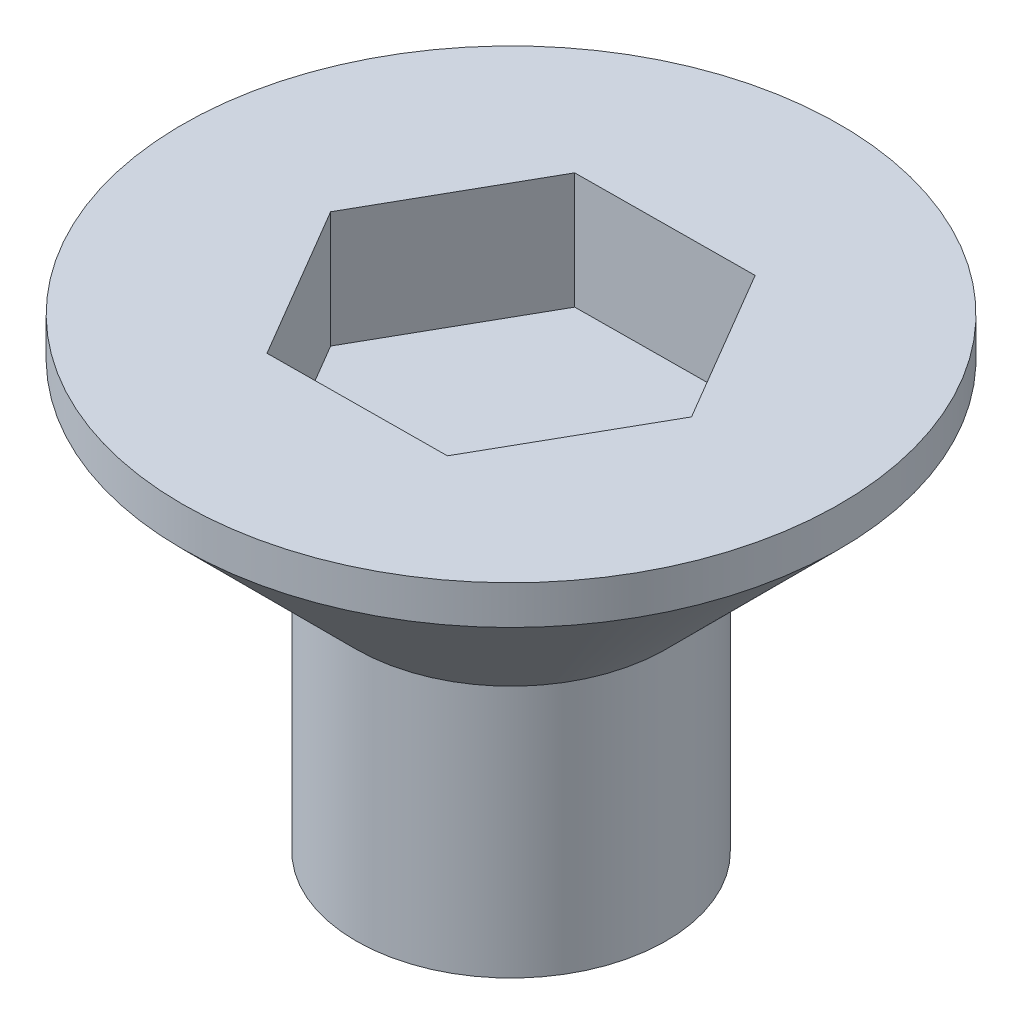
ISO-10303-21;
HEADER;
FILE_DESCRIPTION(('STEP AP214'),'2;1');
FILE_NAME('part.step','',(''),(''),'','','');
FILE_SCHEMA(('AUTOMOTIVE_DESIGN { 1 0 10303 214 1 1 1 1 }'));
ENDSEC;
DATA;
#1=APPLICATION_CONTEXT('core data for automotive mechanical design processes');
#2=APPLICATION_PROTOCOL_DEFINITION('international standard','automotive_design',2000,#1);
#3=PRODUCT_CONTEXT('',#1,'mechanical');
#4=PRODUCT('Part','Part','',(#3));
#5=PRODUCT_RELATED_PRODUCT_CATEGORY('part','',(#4));
#6=PRODUCT_DEFINITION_FORMATION('','',#4);
#7=PRODUCT_DEFINITION_CONTEXT('part definition',#1,'design');
#8=PRODUCT_DEFINITION('design','',#6,#7);
#9=PRODUCT_DEFINITION_SHAPE('','',#8);
#10=(LENGTH_UNIT() NAMED_UNIT(*) SI_UNIT(.MILLI.,.METRE.));
#11=(NAMED_UNIT(*) PLANE_ANGLE_UNIT() SI_UNIT($,.RADIAN.));
#12=(NAMED_UNIT(*) SI_UNIT($,.STERADIAN.) SOLID_ANGLE_UNIT());
#13=UNCERTAINTY_MEASURE_WITH_UNIT(LENGTH_MEASURE(1.E-05),#10,'distance_accuracy_value','');
#14=(GEOMETRIC_REPRESENTATION_CONTEXT(3) GLOBAL_UNCERTAINTY_ASSIGNED_CONTEXT((#13)) GLOBAL_UNIT_ASSIGNED_CONTEXT((#10,
#11,#12)) REPRESENTATION_CONTEXT('',''));
#15=CARTESIAN_POINT('',(0.,0.,0.));
#16=DIRECTION('',(0.,0.,1.));
#17=DIRECTION('',(1.,0.,0.));
#18=AXIS2_PLACEMENT_3D('',#15,#16,#17);
#19=CARTESIAN_POINT('',(0.,0.,0.));
#20=DIRECTION('',(0.,1.,0.));
#21=DIRECTION('',(0.,0.,1.));
#22=AXIS2_PLACEMENT_3D('',#19,#20,#21);
#23=PLANE('',#22);
#24=CARTESIAN_POINT('',(0.,0.,0.));
#25=DIRECTION('',(0.,1.,0.));
#26=DIRECTION('',(0.,0.,1.));
#27=AXIS2_PLACEMENT_3D('',#24,#25,#26);
#28=CIRCLE('',#27,4.);
#29=CARTESIAN_POINT('',(0.,0.,4.));
#30=VERTEX_POINT('',#29);
#31=EDGE_CURVE('E11',#30,#30,#28,.T.);
#32=ORIENTED_EDGE('',*,*,#31,.F.);
#33=EDGE_LOOP('',(#32));
#34=FACE_BOUND('',#33,.T.);
#35=ADVANCED_FACE('F34',(#34),#23,.F.);
#36=CARTESIAN_POINT('',(0.,68.6445759886598,0.));
#37=DIRECTION('',(0.,1.,0.));
#38=DIRECTION('',(0.,0.,1.));
#39=AXIS2_PLACEMENT_3D('',#36,#37,#38);
#40=CYLINDRICAL_SURFACE('',#39,4.);
#41=CARTESIAN_POINT('',(0.,6.51943144453926,0.));
#42=DIRECTION('',(0.,1.,0.));
#43=DIRECTION('',(0.,0.,1.));
#44=AXIS2_PLACEMENT_3D('',#41,#42,#43);
#45=CIRCLE('',#44,4.);
#46=CARTESIAN_POINT('',(0.,6.51943144453926,4.));
#47=VERTEX_POINT('',#46);
#48=EDGE_CURVE('E41',#47,#47,#45,.T.);
#49=ORIENTED_EDGE('',*,*,#48,.F.);
#50=EDGE_LOOP('',(#49));
#51=FACE_BOUND('',#50,.T.);
#52=ORIENTED_EDGE('',*,*,#31,.T.);
#53=EDGE_LOOP('',(#52));
#54=FACE_BOUND('',#53,.T.);
#55=ADVANCED_FACE('F150',(#51,#54),#40,.T.);
#56=CARTESIAN_POINT('',(0.,6.51943144453926,0.));
#57=DIRECTION('',(0.,1.,0.));
#58=DIRECTION('',(0.,0.,1.));
#59=AXIS2_PLACEMENT_3D('',#56,#57,#58);
#60=CONICAL_SURFACE('',#59,4.,0.785398163397447);
#61=CARTESIAN_POINT('',(0.,11.,0.));
#62=DIRECTION('',(0.,1.,0.));
#63=DIRECTION('',(0.,0.,1.));
#64=AXIS2_PLACEMENT_3D('',#61,#62,#63);
#65=CIRCLE('',#64,8.48056855546072);
#66=CARTESIAN_POINT('',(0.,11.,8.48056855546072));
#67=VERTEX_POINT('',#66);
#68=EDGE_CURVE('E143',#67,#67,#65,.T.);
#69=ORIENTED_EDGE('',*,*,#68,.F.);
#70=EDGE_LOOP('',(#69));
#71=FACE_BOUND('',#70,.T.);
#72=ORIENTED_EDGE('',*,*,#48,.T.);
#73=EDGE_LOOP('',(#72));
#74=FACE_BOUND('',#73,.T.);
#75=ADVANCED_FACE('F148',(#71,#74),#60,.T.);
#76=CARTESIAN_POINT('',(0.,68.6445759886598,0.));
#77=DIRECTION('',(0.,1.,0.));
#78=DIRECTION('',(0.,0.,1.));
#79=AXIS2_PLACEMENT_3D('',#76,#77,#78);
#80=CYLINDRICAL_SURFACE('',#79,8.48056855546072);
#81=CARTESIAN_POINT('',(0.,12.,0.));
#82=DIRECTION('',(0.,1.,0.));
#83=DIRECTION('',(0.,0.,1.));
#84=AXIS2_PLACEMENT_3D('',#81,#82,#83);
#85=CIRCLE('',#84,8.48056855546072);
#86=CARTESIAN_POINT('',(0.,12.,8.48056855546072));
#87=VERTEX_POINT('',#86);
#88=EDGE_CURVE('E135',#87,#87,#85,.T.);
#89=ORIENTED_EDGE('',*,*,#88,.F.);
#90=EDGE_LOOP('',(#89));
#91=FACE_BOUND('',#90,.T.);
#92=ORIENTED_EDGE('',*,*,#68,.T.);
#93=EDGE_LOOP('',(#92));
#94=FACE_BOUND('',#93,.T.);
#95=ADVANCED_FACE('F168',(#91,#94),#80,.T.);
#96=CARTESIAN_POINT('',(8.48056855546072,12.,0.));
#97=DIRECTION('',(0.,-1.,0.));
#98=DIRECTION('',(0.,0.,-1.));
#99=AXIS2_PLACEMENT_3D('',#96,#97,#98);
#100=PLANE('',#99);
#101=DIRECTION('',(0.493268448593922,0.,-0.869877139383342));
#102=VECTOR('',#101,1.);
#103=CARTESIAN_POINT('',(2.34035387121957,12.,3.98196899671519));
#104=LINE('',#103,#102);
#105=CARTESIAN_POINT('',(2.34035387121957,12.,3.98196899671519));
#106=VERTEX_POINT('',#105);
#107=CARTESIAN_POINT('',(4.61866324384717,12.,-0.035821407963807));
#108=VERTEX_POINT('',#107);
#109=EDGE_CURVE('E122',#106,#108,#104,.T.);
#110=ORIENTED_EDGE('',*,*,#109,.F.);
#111=DIRECTION('',(0.999969925174272,0.,-0.00775556232399538));
#112=VECTOR('',#111,1.);
#113=CARTESIAN_POINT('',(-2.2783093726276,12.,4.01779040467899));
#114=LINE('',#113,#112);
#115=CARTESIAN_POINT('',(-2.2783093726276,12.,4.01779040467899));
#116=VERTEX_POINT('',#115);
#117=EDGE_CURVE('E48',#116,#106,#114,.T.);
#118=ORIENTED_EDGE('',*,*,#117,.F.);
#119=DIRECTION('',(0.50670147658035,0.,0.862121577059346));
#120=VECTOR('',#119,1.);
#121=CARTESIAN_POINT('',(-4.61866324384717,12.,0.0358214079638057));
#122=LINE('',#121,#120);
#123=CARTESIAN_POINT('',(-4.61866324384717,12.,0.0358214079638057));
#124=VERTEX_POINT('',#123);
#125=EDGE_CURVE('E131',#124,#116,#122,.T.);
#126=ORIENTED_EDGE('',*,*,#125,.F.);
#127=DIRECTION('',(-0.493268448593922,0.,0.869877139383341));
#128=VECTOR('',#127,1.);
#129=CARTESIAN_POINT('',(-2.34035387121957,12.,-3.98196899671519));
#130=LINE('',#129,#128);
#131=CARTESIAN_POINT('',(-2.34035387121957,12.,-3.98196899671519));
#132=VERTEX_POINT('',#131);
#133=EDGE_CURVE('E129',#132,#124,#130,.T.);
#134=ORIENTED_EDGE('',*,*,#133,.F.);
#135=DIRECTION('',(-0.999969925174272,0.,0.00775556232399538));
#136=VECTOR('',#135,1.);
#137=CARTESIAN_POINT('',(2.2783093726276,12.,-4.01779040467899));
#138=LINE('',#137,#136);
#139=CARTESIAN_POINT('',(2.2783093726276,12.,-4.01779040467899));
#140=VERTEX_POINT('',#139);
#141=EDGE_CURVE('E96',#140,#132,#138,.T.);
#142=ORIENTED_EDGE('',*,*,#141,.F.);
#143=DIRECTION('',(-0.506701476580349,0.,-0.862121577059346));
#144=VECTOR('',#143,1.);
#145=CARTESIAN_POINT('',(4.61866324384717,12.,-0.035821407963807));
#146=LINE('',#145,#144);
#147=EDGE_CURVE('E125',#108,#140,#146,.T.);
#148=ORIENTED_EDGE('',*,*,#147,.F.);
#149=EDGE_LOOP('',(#110,#118,#126,#134,#142,#148));
#150=FACE_BOUND('',#149,.T.);
#151=ORIENTED_EDGE('',*,*,#88,.T.);
#152=EDGE_LOOP('',(#151));
#153=FACE_BOUND('',#152,.T.);
#154=ADVANCED_FACE('F176',(#150,#153),#100,.F.);
#155=CARTESIAN_POINT('',(-2.2783093726276,9.,4.01779040467899));
#156=DIRECTION('',(0.00775556232399537,0.,0.999969925174272));
#157=DIRECTION('',(0.999969925174272,0.,-0.00775556232399538));
#158=AXIS2_PLACEMENT_3D('',#155,#156,#157);
#159=PLANE('',#158);
#160=ORIENTED_EDGE('',*,*,#117,.T.);
#161=DIRECTION('',(0.,1.,0.));
#162=VECTOR('',#161,1.);
#163=CARTESIAN_POINT('',(2.34035387121957,9.,3.98196899671519));
#164=LINE('',#163,#162);
#165=CARTESIAN_POINT('',(2.34035387121957,9.,3.98196899671519));
#166=VERTEX_POINT('',#165);
#167=EDGE_CURVE('E78',#166,#106,#164,.T.);
#168=ORIENTED_EDGE('',*,*,#167,.F.);
#169=DIRECTION('',(0.999969925174272,0.,-0.00775556232399538));
#170=VECTOR('',#169,1.);
#171=CARTESIAN_POINT('',(-2.2783093726276,9.,4.01779040467899));
#172=LINE('',#171,#170);
#173=CARTESIAN_POINT('',(-2.2783093726276,9.,4.01779040467899));
#174=VERTEX_POINT('',#173);
#175=EDGE_CURVE('E133',#174,#166,#172,.T.);
#176=ORIENTED_EDGE('',*,*,#175,.F.);
#177=DIRECTION('',(0.,1.,0.));
#178=VECTOR('',#177,1.);
#179=CARTESIAN_POINT('',(-2.2783093726276,9.,4.01779040467899));
#180=LINE('',#179,#178);
#181=EDGE_CURVE('E56',#174,#116,#180,.T.);
#182=ORIENTED_EDGE('',*,*,#181,.T.);
#183=EDGE_LOOP('',(#160,#168,#176,#182));
#184=FACE_BOUND('',#183,.T.);
#185=ADVANCED_FACE('F184',(#184),#159,.F.);
#186=CARTESIAN_POINT('',(-4.61866324384717,9.,0.0358214079638057));
#187=DIRECTION('',(-0.862121577059346,0.,0.50670147658035));
#188=DIRECTION('',(0.50670147658035,0.,0.862121577059346));
#189=AXIS2_PLACEMENT_3D('',#186,#187,#188);
#190=PLANE('',#189);
#191=ORIENTED_EDGE('',*,*,#125,.T.);
#192=ORIENTED_EDGE('',*,*,#181,.F.);
#193=DIRECTION('',(0.50670147658035,0.,0.862121577059346));
#194=VECTOR('',#193,1.);
#195=CARTESIAN_POINT('',(-4.61866324384717,9.,0.0358214079638057));
#196=LINE('',#195,#194);
#197=CARTESIAN_POINT('',(-4.61866324384717,9.,0.0358214079638057));
#198=VERTEX_POINT('',#197);
#199=EDGE_CURVE('E108',#198,#174,#196,.T.);
#200=ORIENTED_EDGE('',*,*,#199,.F.);
#201=DIRECTION('',(0.,1.,0.));
#202=VECTOR('',#201,1.);
#203=CARTESIAN_POINT('',(-4.61866324384717,9.,0.0358214079638057));
#204=LINE('',#203,#202);
#205=EDGE_CURVE('E100',#198,#124,#204,.T.);
#206=ORIENTED_EDGE('',*,*,#205,.T.);
#207=EDGE_LOOP('',(#191,#192,#200,#206));
#208=FACE_BOUND('',#207,.T.);
#209=ADVANCED_FACE('F192',(#208),#190,.F.);
#210=CARTESIAN_POINT('',(-2.34035387121957,9.,-3.98196899671519));
#211=DIRECTION('',(-0.869877139383341,0.,-0.493268448593922));
#212=DIRECTION('',(-0.493268448593922,0.,0.869877139383342));
#213=AXIS2_PLACEMENT_3D('',#210,#211,#212);
#214=PLANE('',#213);
#215=ORIENTED_EDGE('',*,*,#133,.T.);
#216=ORIENTED_EDGE('',*,*,#205,.F.);
#217=DIRECTION('',(-0.493268448593922,0.,0.869877139383341));
#218=VECTOR('',#217,1.);
#219=CARTESIAN_POINT('',(-2.34035387121957,9.,-3.98196899671519));
#220=LINE('',#219,#218);
#221=CARTESIAN_POINT('',(-2.34035387121957,9.,-3.98196899671519));
#222=VERTEX_POINT('',#221);
#223=EDGE_CURVE('E104',#222,#198,#220,.T.);
#224=ORIENTED_EDGE('',*,*,#223,.F.);
#225=DIRECTION('',(0.,1.,0.));
#226=VECTOR('',#225,1.);
#227=CARTESIAN_POINT('',(-2.34035387121957,9.,-3.98196899671519));
#228=LINE('',#227,#226);
#229=EDGE_CURVE('E89',#222,#132,#228,.T.);
#230=ORIENTED_EDGE('',*,*,#229,.T.);
#231=EDGE_LOOP('',(#215,#216,#224,#230));
#232=FACE_BOUND('',#231,.T.);
#233=ADVANCED_FACE('F105',(#232),#214,.F.);
#234=CARTESIAN_POINT('',(2.2783093726276,9.,-4.01779040467899));
#235=DIRECTION('',(-0.00775556232399538,0.,-0.999969925174272));
#236=DIRECTION('',(-0.999969925174272,0.,0.00775556232399538));
#237=AXIS2_PLACEMENT_3D('',#234,#235,#236);
#238=PLANE('',#237);
#239=ORIENTED_EDGE('',*,*,#141,.T.);
#240=ORIENTED_EDGE('',*,*,#229,.F.);
#241=DIRECTION('',(-0.999969925174272,0.,0.00775556232399538));
#242=VECTOR('',#241,1.);
#243=CARTESIAN_POINT('',(2.2783093726276,9.,-4.01779040467899));
#244=LINE('',#243,#242);
#245=CARTESIAN_POINT('',(2.2783093726276,9.,-4.01779040467899));
#246=VERTEX_POINT('',#245);
#247=EDGE_CURVE('E93',#246,#222,#244,.T.);
#248=ORIENTED_EDGE('',*,*,#247,.F.);
#249=DIRECTION('',(0.,1.,0.));
#250=VECTOR('',#249,1.);
#251=CARTESIAN_POINT('',(2.2783093726276,9.,-4.01779040467899));
#252=LINE('',#251,#250);
#253=EDGE_CURVE('E101',#246,#140,#252,.T.);
#254=ORIENTED_EDGE('',*,*,#253,.T.);
#255=EDGE_LOOP('',(#239,#240,#248,#254));
#256=FACE_BOUND('',#255,.T.);
#257=ADVANCED_FACE('F91',(#256),#238,.F.);
#258=CARTESIAN_POINT('',(4.61866324384717,9.,-0.035821407963807));
#259=DIRECTION('',(0.862121577059346,0.,-0.506701476580349));
#260=DIRECTION('',(-0.506701476580349,0.,-0.862121577059346));
#261=AXIS2_PLACEMENT_3D('',#258,#259,#260);
#262=PLANE('',#261);
#263=ORIENTED_EDGE('',*,*,#147,.T.);
#264=ORIENTED_EDGE('',*,*,#253,.F.);
#265=DIRECTION('',(-0.506701476580349,0.,-0.862121577059346));
#266=VECTOR('',#265,1.);
#267=CARTESIAN_POINT('',(4.61866324384717,9.,-0.035821407963807));
#268=LINE('',#267,#266);
#269=CARTESIAN_POINT('',(4.61866324384717,9.,-0.035821407963807));
#270=VERTEX_POINT('',#269);
#271=EDGE_CURVE('E114',#270,#246,#268,.T.);
#272=ORIENTED_EDGE('',*,*,#271,.F.);
#273=DIRECTION('',(0.,1.,0.));
#274=VECTOR('',#273,1.);
#275=CARTESIAN_POINT('',(4.61866324384717,9.,-0.035821407963807));
#276=LINE('',#275,#274);
#277=EDGE_CURVE('E138',#270,#108,#276,.T.);
#278=ORIENTED_EDGE('',*,*,#277,.T.);
#279=EDGE_LOOP('',(#263,#264,#272,#278));
#280=FACE_BOUND('',#279,.T.);
#281=ADVANCED_FACE('F211',(#280),#262,.F.);
#282=CARTESIAN_POINT('',(2.34035387121957,9.,3.98196899671519));
#283=DIRECTION('',(0.869877139383341,0.,0.493268448593922));
#284=DIRECTION('',(0.493268448593922,0.,-0.869877139383342));
#285=AXIS2_PLACEMENT_3D('',#282,#283,#284);
#286=PLANE('',#285);
#287=ORIENTED_EDGE('',*,*,#109,.T.);
#288=ORIENTED_EDGE('',*,*,#277,.F.);
#289=DIRECTION('',(0.493268448593922,0.,-0.869877139383342));
#290=VECTOR('',#289,1.);
#291=CARTESIAN_POINT('',(2.34035387121957,9.,3.98196899671519));
#292=LINE('',#291,#290);
#293=EDGE_CURVE('E116',#166,#270,#292,.T.);
#294=ORIENTED_EDGE('',*,*,#293,.F.);
#295=ORIENTED_EDGE('',*,*,#167,.T.);
#296=EDGE_LOOP('',(#287,#288,#294,#295));
#297=FACE_BOUND('',#296,.T.);
#298=ADVANCED_FACE('F218',(#297),#286,.F.);
#299=CARTESIAN_POINT('',(0.,9.,0.));
#300=DIRECTION('',(0.,1.,0.));
#301=DIRECTION('',(0.,0.,1.));
#302=AXIS2_PLACEMENT_3D('',#299,#300,#301);
#303=PLANE('',#302);
#304=ORIENTED_EDGE('',*,*,#175,.T.);
#305=ORIENTED_EDGE('',*,*,#293,.T.);
#306=ORIENTED_EDGE('',*,*,#271,.T.);
#307=ORIENTED_EDGE('',*,*,#247,.T.);
#308=ORIENTED_EDGE('',*,*,#223,.T.);
#309=ORIENTED_EDGE('',*,*,#199,.T.);
#310=EDGE_LOOP('',(#304,#305,#306,#307,#308,#309));
#311=FACE_BOUND('',#310,.T.);
#312=ADVANCED_FACE('F111',(#311),#303,.T.);
#313=CLOSED_SHELL('',(#35,#55,#75,#95,#154,#185,#209,#233,#257,#281,#298,#312));
#314=MANIFOLD_SOLID_BREP('B2',#313);
#315=ADVANCED_BREP_SHAPE_REPRESENTATION('',(#18,#314),#14);
#316=SHAPE_DEFINITION_REPRESENTATION(#9,#315);
ENDSEC;
END-ISO-10303-21;
